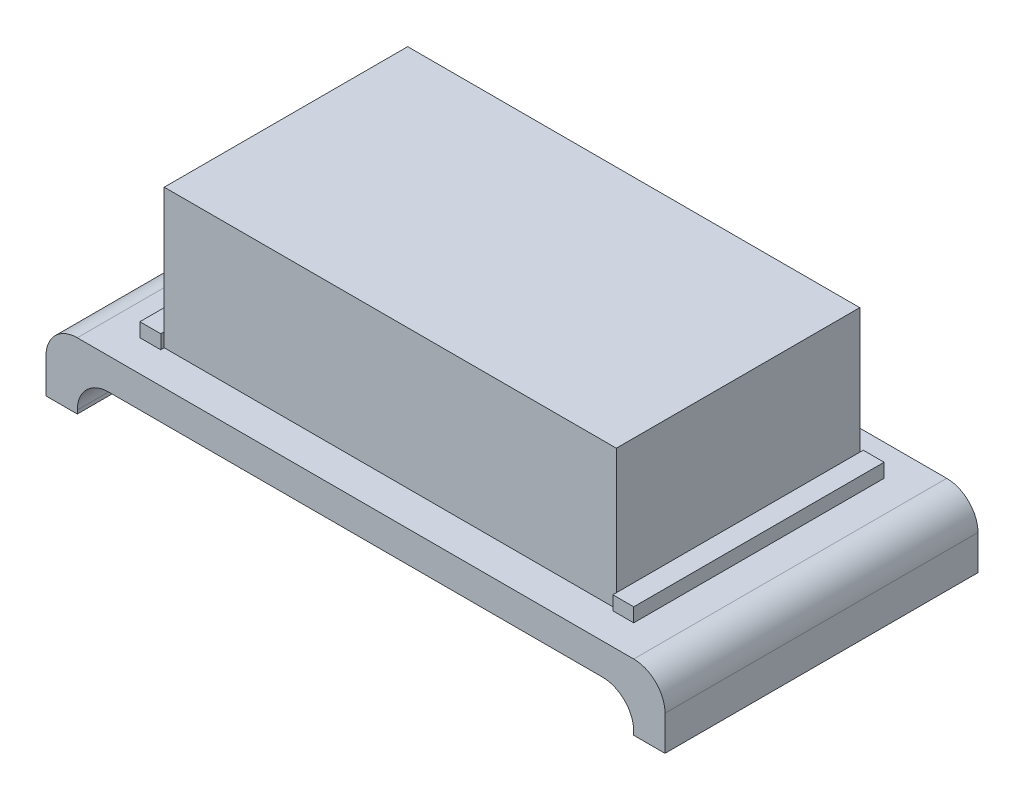
ISO-10303-21;
HEADER;
FILE_DESCRIPTION(('STEP AP214'),'2;1');
FILE_NAME('part.step','',(''),(''),'','','');
FILE_SCHEMA(('AUTOMOTIVE_DESIGN { 1 0 10303 214 1 1 1 1 }'));
ENDSEC;
DATA;
#1=APPLICATION_CONTEXT('core data for automotive mechanical design processes');
#2=APPLICATION_PROTOCOL_DEFINITION('international standard','automotive_design',2000,#1);
#3=PRODUCT_CONTEXT('',#1,'mechanical');
#4=PRODUCT('Part','Part','',(#3));
#5=PRODUCT_RELATED_PRODUCT_CATEGORY('part','',(#4));
#6=PRODUCT_DEFINITION_FORMATION('','',#4);
#7=PRODUCT_DEFINITION_CONTEXT('part definition',#1,'design');
#8=PRODUCT_DEFINITION('design','',#6,#7);
#9=PRODUCT_DEFINITION_SHAPE('','',#8);
#10=(LENGTH_UNIT() NAMED_UNIT(*) SI_UNIT(.MILLI.,.METRE.));
#11=(NAMED_UNIT(*) PLANE_ANGLE_UNIT() SI_UNIT($,.RADIAN.));
#12=(NAMED_UNIT(*) SI_UNIT($,.STERADIAN.) SOLID_ANGLE_UNIT());
#13=UNCERTAINTY_MEASURE_WITH_UNIT(LENGTH_MEASURE(1.E-05),#10,'distance_accuracy_value','');
#14=(GEOMETRIC_REPRESENTATION_CONTEXT(3) GLOBAL_UNCERTAINTY_ASSIGNED_CONTEXT((#13)) GLOBAL_UNIT_ASSIGNED_CONTEXT((#10,
#11,#12)) REPRESENTATION_CONTEXT('',''));
#15=CARTESIAN_POINT('',(0.,0.,0.));
#16=DIRECTION('',(0.,0.,1.));
#17=DIRECTION('',(1.,0.,0.));
#18=AXIS2_PLACEMENT_3D('',#15,#16,#17);
#19=CARTESIAN_POINT('',(-61.1375342465753,0.,56.3397260273973));
#20=DIRECTION('',(0.,1.,0.));
#21=DIRECTION('',(0.,0.,1.));
#22=AXIS2_PLACEMENT_3D('',#19,#20,#21);
#23=PLANE('',#22);
#24=DIRECTION('',(1.,0.,0.));
#25=VECTOR('',#24,1.);
#26=CARTESIAN_POINT('',(-61.1375342465753,0.,56.3397260273973));
#27=LINE('',#26,#25);
#28=CARTESIAN_POINT('',(-61.1375342465753,0.,56.3397260273973));
#29=VERTEX_POINT('',#28);
#30=CARTESIAN_POINT('',(98.8624657534247,0.,56.3397260273973));
#31=VERTEX_POINT('',#30);
#32=EDGE_CURVE('E372',#29,#31,#27,.T.);
#33=ORIENTED_EDGE('',*,*,#32,.T.);
#34=DIRECTION('',(0.,0.,-1.));
#35=VECTOR('',#34,1.);
#36=CARTESIAN_POINT('',(98.8624657534247,0.,56.3397260273972));
#37=LINE('',#36,#35);
#38=CARTESIAN_POINT('',(98.8624657534247,0.,-33.6602739726027));
#39=VERTEX_POINT('',#38);
#40=EDGE_CURVE('E398',#31,#39,#37,.T.);
#41=ORIENTED_EDGE('',*,*,#40,.T.);
#42=DIRECTION('',(-1.,0.,0.));
#43=VECTOR('',#42,1.);
#44=CARTESIAN_POINT('',(-61.1375342465753,0.,-33.6602739726027));
#45=LINE('',#44,#43);
#46=CARTESIAN_POINT('',(-61.1375342465753,0.,-33.6602739726027));
#47=VERTEX_POINT('',#46);
#48=EDGE_CURVE('E375',#39,#47,#45,.T.);
#49=ORIENTED_EDGE('',*,*,#48,.T.);
#50=DIRECTION('',(0.,0.,1.));
#51=VECTOR('',#50,1.);
#52=CARTESIAN_POINT('',(-61.1375342465753,0.,56.3397260273973));
#53=LINE('',#52,#51);
#54=EDGE_CURVE('E395',#47,#29,#53,.T.);
#55=ORIENTED_EDGE('',*,*,#54,.T.);
#56=EDGE_LOOP('',(#33,#41,#49,#55));
#57=FACE_BOUND('',#56,.T.);
#58=DIRECTION('',(-1.,0.,0.));
#59=VECTOR('',#58,1.);
#60=CARTESIAN_POINT('',(-46.1375342465753,0.,-23.6602739726027));
#61=LINE('',#60,#59);
#62=CARTESIAN_POINT('',(83.8624657534247,0.,-23.6602739726027));
#63=VERTEX_POINT('',#62);
#64=CARTESIAN_POINT('',(-46.1375342465753,0.,-23.6602739726027));
#65=VERTEX_POINT('',#64);
#66=EDGE_CURVE('E349',#63,#65,#61,.T.);
#67=ORIENTED_EDGE('',*,*,#66,.F.);
#68=DIRECTION('',(0.,0.,1.));
#69=VECTOR('',#68,1.);
#70=CARTESIAN_POINT('',(83.8624657534247,0.,-24.6602739726027));
#71=LINE('',#70,#69);
#72=CARTESIAN_POINT('',(83.8624657534247,0.,-24.6602739726027));
#73=VERTEX_POINT('',#72);
#74=EDGE_CURVE('E288',#73,#63,#71,.T.);
#75=ORIENTED_EDGE('',*,*,#74,.F.);
#76=DIRECTION('',(-1.,0.,0.));
#77=VECTOR('',#76,1.);
#78=CARTESIAN_POINT('',(83.8624657534247,0.,-24.6602739726027));
#79=LINE('',#78,#77);
#80=CARTESIAN_POINT('',(89.8624657534247,0.,-24.6602739726028));
#81=VERTEX_POINT('',#80);
#82=EDGE_CURVE('E266',#81,#73,#79,.T.);
#83=ORIENTED_EDGE('',*,*,#82,.F.);
#84=DIRECTION('',(0.,0.,-1.));
#85=VECTOR('',#84,1.);
#86=CARTESIAN_POINT('',(89.8624657534247,0.,-24.6602739726028));
#87=LINE('',#86,#85);
#88=CARTESIAN_POINT('',(89.8624657534247,0.,47.3397260273972));
#89=VERTEX_POINT('',#88);
#90=EDGE_CURVE('E275',#89,#81,#87,.T.);
#91=ORIENTED_EDGE('',*,*,#90,.F.);
#92=DIRECTION('',(1.,0.,0.));
#93=VECTOR('',#92,1.);
#94=CARTESIAN_POINT('',(83.8624657534247,0.,47.3397260273972));
#95=LINE('',#94,#93);
#96=CARTESIAN_POINT('',(83.8624657534247,0.,47.3397260273972));
#97=VERTEX_POINT('',#96);
#98=EDGE_CURVE('E290',#97,#89,#95,.T.);
#99=ORIENTED_EDGE('',*,*,#98,.F.);
#100=CARTESIAN_POINT('',(83.8624657534247,0.,46.3397260273973));
#101=VERTEX_POINT('',#100);
#102=EDGE_CURVE('E287',#101,#97,#71,.T.);
#103=ORIENTED_EDGE('',*,*,#102,.F.);
#104=DIRECTION('',(1.,0.,0.));
#105=VECTOR('',#104,1.);
#106=CARTESIAN_POINT('',(-46.1375342465753,0.,46.3397260273973));
#107=LINE('',#106,#105);
#108=CARTESIAN_POINT('',(-46.1375342465753,0.,46.3397260273973));
#109=VERTEX_POINT('',#108);
#110=EDGE_CURVE('E344',#109,#101,#107,.T.);
#111=ORIENTED_EDGE('',*,*,#110,.F.);
#112=DIRECTION('',(0.,0.,-1.));
#113=VECTOR('',#112,1.);
#114=CARTESIAN_POINT('',(-46.1375342465753,0.,-24.6602739726027));
#115=LINE('',#114,#113);
#116=CARTESIAN_POINT('',(-46.1375342465753,0.,47.3397260273973));
#117=VERTEX_POINT('',#116);
#118=EDGE_CURVE('E318',#117,#109,#115,.T.);
#119=ORIENTED_EDGE('',*,*,#118,.F.);
#120=DIRECTION('',(1.,0.,0.));
#121=VECTOR('',#120,1.);
#122=CARTESIAN_POINT('',(-46.1375342465753,0.,47.3397260273973));
#123=LINE('',#122,#121);
#124=CARTESIAN_POINT('',(-52.1375342465753,0.,47.3397260273973));
#125=VERTEX_POINT('',#124);
#126=EDGE_CURVE('E327',#125,#117,#123,.T.);
#127=ORIENTED_EDGE('',*,*,#126,.F.);
#128=DIRECTION('',(0.,0.,1.));
#129=VECTOR('',#128,1.);
#130=CARTESIAN_POINT('',(-52.1375342465753,0.,-24.6602739726027));
#131=LINE('',#130,#129);
#132=CARTESIAN_POINT('',(-52.1375342465753,0.,-24.6602739726027));
#133=VERTEX_POINT('',#132);
#134=EDGE_CURVE('E324',#133,#125,#131,.T.);
#135=ORIENTED_EDGE('',*,*,#134,.F.);
#136=DIRECTION('',(-1.,0.,0.));
#137=VECTOR('',#136,1.);
#138=CARTESIAN_POINT('',(-46.1375342465753,0.,-24.6602739726027));
#139=LINE('',#138,#137);
#140=CARTESIAN_POINT('',(-46.1375342465753,0.,-24.6602739726027));
#141=VERTEX_POINT('',#140);
#142=EDGE_CURVE('E321',#141,#133,#139,.T.);
#143=ORIENTED_EDGE('',*,*,#142,.F.);
#144=EDGE_CURVE('E305',#65,#141,#115,.T.);
#145=ORIENTED_EDGE('',*,*,#144,.F.);
#146=EDGE_LOOP('',(#67,#75,#83,#91,#99,#103,#111,#119,#127,#135,#143,#145));
#147=FACE_BOUND('',#146,.T.);
#148=ADVANCED_FACE('F33',(#57,#147),#23,.T.);
#149=CARTESIAN_POINT('',(83.8624657534247,40.,-23.6602739726027));
#150=DIRECTION('',(-1.,0.,0.));
#151=DIRECTION('',(0.,0.,1.));
#152=AXIS2_PLACEMENT_3D('',#149,#150,#151);
#153=PLANE('',#152);
#154=DIRECTION('',(0.,0.,1.));
#155=VECTOR('',#154,1.);
#156=CARTESIAN_POINT('',(83.8624657534247,4.,-24.6602739726027));
#157=LINE('',#156,#155);
#158=CARTESIAN_POINT('',(83.8624657534247,4.,-23.6602739726027));
#159=VERTEX_POINT('',#158);
#160=CARTESIAN_POINT('',(83.8624657534247,4.,46.3397260273973));
#161=VERTEX_POINT('',#160);
#162=EDGE_CURVE('E280',#159,#161,#157,.T.);
#163=ORIENTED_EDGE('',*,*,#162,.F.);
#164=DIRECTION('',(0.,-1.,0.));
#165=VECTOR('',#164,1.);
#166=CARTESIAN_POINT('',(83.8624657534247,40.,-23.6602739726027));
#167=LINE('',#166,#165);
#168=CARTESIAN_POINT('',(83.8624657534247,40.,-23.6602739726027));
#169=VERTEX_POINT('',#168);
#170=EDGE_CURVE('E363',#169,#159,#167,.T.);
#171=ORIENTED_EDGE('',*,*,#170,.F.);
#172=DIRECTION('',(0.,0.,-1.));
#173=VECTOR('',#172,1.);
#174=CARTESIAN_POINT('',(83.8624657534247,40.,-23.6602739726027));
#175=LINE('',#174,#173);
#176=CARTESIAN_POINT('',(83.8624657534247,40.,46.3397260273973));
#177=VERTEX_POINT('',#176);
#178=EDGE_CURVE('E351',#177,#169,#175,.T.);
#179=ORIENTED_EDGE('',*,*,#178,.F.);
#180=DIRECTION('',(0.,-1.,0.));
#181=VECTOR('',#180,1.);
#182=CARTESIAN_POINT('',(83.8624657534247,40.,46.3397260273973));
#183=LINE('',#182,#181);
#184=EDGE_CURVE('E366',#177,#161,#183,.T.);
#185=ORIENTED_EDGE('',*,*,#184,.T.);
#186=EDGE_LOOP('',(#163,#171,#179,#185));
#187=FACE_BOUND('',#186,.T.);
#188=ADVANCED_FACE('F461',(#187),#153,.F.);
#189=CARTESIAN_POINT('',(-46.1375342465753,40.,-23.6602739726027));
#190=DIRECTION('',(1.,0.,0.));
#191=DIRECTION('',(0.,0.,-1.));
#192=AXIS2_PLACEMENT_3D('',#189,#190,#191);
#193=PLANE('',#192);
#194=DIRECTION('',(0.,0.,-1.));
#195=VECTOR('',#194,1.);
#196=CARTESIAN_POINT('',(-46.1375342465753,4.,-24.6602739726027));
#197=LINE('',#196,#195);
#198=CARTESIAN_POINT('',(-46.1375342465753,4.,46.3397260273973));
#199=VERTEX_POINT('',#198);
#200=CARTESIAN_POINT('',(-46.1375342465753,4.,-23.6602739726027));
#201=VERTEX_POINT('',#200);
#202=EDGE_CURVE('E310',#199,#201,#197,.T.);
#203=ORIENTED_EDGE('',*,*,#202,.F.);
#204=DIRECTION('',(0.,-1.,0.));
#205=VECTOR('',#204,1.);
#206=CARTESIAN_POINT('',(-46.1375342465753,40.,46.3397260273973));
#207=LINE('',#206,#205);
#208=CARTESIAN_POINT('',(-46.1375342465753,40.,46.3397260273973));
#209=VERTEX_POINT('',#208);
#210=EDGE_CURVE('E369',#209,#199,#207,.T.);
#211=ORIENTED_EDGE('',*,*,#210,.F.);
#212=DIRECTION('',(0.,0.,1.));
#213=VECTOR('',#212,1.);
#214=CARTESIAN_POINT('',(-46.1375342465753,40.,-23.6602739726027));
#215=LINE('',#214,#213);
#216=CARTESIAN_POINT('',(-46.1375342465753,40.,-23.6602739726027));
#217=VERTEX_POINT('',#216);
#218=EDGE_CURVE('E345',#217,#209,#215,.T.);
#219=ORIENTED_EDGE('',*,*,#218,.F.);
#220=DIRECTION('',(0.,-1.,0.));
#221=VECTOR('',#220,1.);
#222=CARTESIAN_POINT('',(-46.1375342465753,40.,-23.6602739726027));
#223=LINE('',#222,#221);
#224=EDGE_CURVE('E359',#217,#201,#223,.T.);
#225=ORIENTED_EDGE('',*,*,#224,.T.);
#226=EDGE_LOOP('',(#203,#211,#219,#225));
#227=FACE_BOUND('',#226,.T.);
#228=ADVANCED_FACE('F466',(#227),#193,.F.);
#229=CARTESIAN_POINT('',(-61.1375342465753,-9.,-33.6602739726027));
#230=DIRECTION('',(0.,0.,-1.));
#231=DIRECTION('',(-1.,0.,0.));
#232=AXIS2_PLACEMENT_3D('',#229,#230,#231);
#233=PLANE('',#232);
#234=ORIENTED_EDGE('',*,*,#48,.F.);
#235=CARTESIAN_POINT('',(98.8624657534247,-9.,-33.6602739726027));
#236=DIRECTION('',(0.,0.,-1.));
#237=DIRECTION('',(-1.,0.,0.));
#238=AXIS2_PLACEMENT_3D('',#235,#236,#237);
#239=CIRCLE('',#238,9.);
#240=CARTESIAN_POINT('',(107.862465753425,-9.,-33.6602739726027));
#241=VERTEX_POINT('',#240);
#242=EDGE_CURVE('E403',#39,#241,#239,.T.);
#243=ORIENTED_EDGE('',*,*,#242,.T.);
#244=DIRECTION('',(0.,1.,0.));
#245=VECTOR('',#244,1.);
#246=CARTESIAN_POINT('',(107.862465753425,-19.,-33.6602739726027));
#247=LINE('',#246,#245);
#248=CARTESIAN_POINT('',(107.862465753425,-19.,-33.6602739726027));
#249=VERTEX_POINT('',#248);
#250=EDGE_CURVE('E238',#249,#241,#247,.T.);
#251=ORIENTED_EDGE('',*,*,#250,.F.);
#252=DIRECTION('',(-1.,0.,0.));
#253=VECTOR('',#252,1.);
#254=CARTESIAN_POINT('',(98.8624657534247,-19.,-33.6602739726027));
#255=LINE('',#254,#253);
#256=CARTESIAN_POINT('',(98.8624657534247,-19.,-33.6602739726027));
#257=VERTEX_POINT('',#256);
#258=EDGE_CURVE('E217',#249,#257,#255,.T.);
#259=ORIENTED_EDGE('',*,*,#258,.T.);
#260=DIRECTION('',(0.,1.,0.));
#261=VECTOR('',#260,1.);
#262=CARTESIAN_POINT('',(98.8624657534247,-19.,-33.6602739726027));
#263=LINE('',#262,#261);
#264=CARTESIAN_POINT('',(98.8624657534247,-18.,-33.6602739726027));
#265=VERTEX_POINT('',#264);
#266=EDGE_CURVE('E231',#257,#265,#263,.T.);
#267=ORIENTED_EDGE('',*,*,#266,.T.);
#268=CARTESIAN_POINT('',(89.8624657534247,-18.,-33.6602739726027));
#269=DIRECTION('',(0.,0.,-1.));
#270=DIRECTION('',(-1.,0.,0.));
#271=AXIS2_PLACEMENT_3D('',#268,#269,#270);
#272=CIRCLE('',#271,9.);
#273=CARTESIAN_POINT('',(89.8624657534247,-9.,-33.6602739726027));
#274=VERTEX_POINT('',#273);
#275=EDGE_CURVE('E411',#265,#274,#272,.F.);
#276=ORIENTED_EDGE('',*,*,#275,.T.);
#277=DIRECTION('',(-1.,0.,0.));
#278=VECTOR('',#277,1.);
#279=CARTESIAN_POINT('',(-61.1375342465753,-9.,-33.6602739726027));
#280=LINE('',#279,#278);
#281=CARTESIAN_POINT('',(-52.1375342465753,-9.,-33.6602739726027));
#282=VERTEX_POINT('',#281);
#283=EDGE_CURVE('E386',#274,#282,#280,.T.);
#284=ORIENTED_EDGE('',*,*,#283,.T.);
#285=CARTESIAN_POINT('',(-52.1375342465753,-18.,-33.6602739726027));
#286=DIRECTION('',(0.,0.,-1.));
#287=DIRECTION('',(-1.,0.,0.));
#288=AXIS2_PLACEMENT_3D('',#285,#286,#287);
#289=CIRCLE('',#288,9.);
#290=CARTESIAN_POINT('',(-61.1375342465753,-18.,-33.6602739726027));
#291=VERTEX_POINT('',#290);
#292=EDGE_CURVE('E11',#282,#291,#289,.F.);
#293=ORIENTED_EDGE('',*,*,#292,.T.);
#294=DIRECTION('',(0.,1.,0.));
#295=VECTOR('',#294,1.);
#296=CARTESIAN_POINT('',(-61.1375342465753,-19.,-33.6602739726027));
#297=LINE('',#296,#295);
#298=CARTESIAN_POINT('',(-61.1375342465753,-19.,-33.6602739726027));
#299=VERTEX_POINT('',#298);
#300=EDGE_CURVE('E256',#299,#291,#297,.T.);
#301=ORIENTED_EDGE('',*,*,#300,.F.);
#302=DIRECTION('',(-1.,0.,0.));
#303=VECTOR('',#302,1.);
#304=CARTESIAN_POINT('',(-61.1375342465753,-19.,-33.6602739726027));
#305=LINE('',#304,#303);
#306=CARTESIAN_POINT('',(-70.1375342465753,-19.,-33.6602739726027));
#307=VERTEX_POINT('',#306);
#308=EDGE_CURVE('E247',#299,#307,#305,.T.);
#309=ORIENTED_EDGE('',*,*,#308,.T.);
#310=DIRECTION('',(0.,1.,0.));
#311=VECTOR('',#310,1.);
#312=CARTESIAN_POINT('',(-70.1375342465753,-19.,-33.6602739726027));
#313=LINE('',#312,#311);
#314=CARTESIAN_POINT('',(-70.1375342465753,-9.,-33.6602739726027));
#315=VERTEX_POINT('',#314);
#316=EDGE_CURVE('E270',#307,#315,#313,.T.);
#317=ORIENTED_EDGE('',*,*,#316,.T.);
#318=CARTESIAN_POINT('',(-61.1375342465753,-9.,-33.6602739726027));
#319=DIRECTION('',(0.,0.,-1.));
#320=DIRECTION('',(-1.,0.,0.));
#321=AXIS2_PLACEMENT_3D('',#318,#319,#320);
#322=CIRCLE('',#321,9.);
#323=EDGE_CURVE('E401',#315,#47,#322,.T.);
#324=ORIENTED_EDGE('',*,*,#323,.T.);
#325=EDGE_LOOP('',(#234,#243,#251,#259,#267,#276,#284,#293,#301,#309,#317,#324));
#326=FACE_BOUND('',#325,.T.);
#327=ADVANCED_FACE('F426',(#326),#233,.T.);
#328=CARTESIAN_POINT('',(-61.1375342465753,-9.,56.3397260273973));
#329=DIRECTION('',(0.,0.,1.));
#330=DIRECTION('',(1.,0.,0.));
#331=AXIS2_PLACEMENT_3D('',#328,#329,#330);
#332=PLANE('',#331);
#333=DIRECTION('',(0.,1.,0.));
#334=VECTOR('',#333,1.);
#335=CARTESIAN_POINT('',(107.862465753425,-19.,56.3397260273973));
#336=LINE('',#335,#334);
#337=CARTESIAN_POINT('',(107.862465753425,-19.,56.3397260273973));
#338=VERTEX_POINT('',#337);
#339=CARTESIAN_POINT('',(107.862465753425,-9.,56.3397260273973));
#340=VERTEX_POINT('',#339);
#341=EDGE_CURVE('E216',#338,#340,#336,.T.);
#342=ORIENTED_EDGE('',*,*,#341,.T.);
#343=CARTESIAN_POINT('',(98.8624657534247,-9.,56.3397260273973));
#344=DIRECTION('',(0.,0.,1.));
#345=DIRECTION('',(1.,0.,0.));
#346=AXIS2_PLACEMENT_3D('',#343,#344,#345);
#347=CIRCLE('',#346,9.);
#348=EDGE_CURVE('E407',#340,#31,#347,.T.);
#349=ORIENTED_EDGE('',*,*,#348,.T.);
#350=ORIENTED_EDGE('',*,*,#32,.F.);
#351=CARTESIAN_POINT('',(-61.1375342465753,-9.,56.3397260273973));
#352=DIRECTION('',(0.,0.,1.));
#353=DIRECTION('',(1.,0.,0.));
#354=AXIS2_PLACEMENT_3D('',#351,#352,#353);
#355=CIRCLE('',#354,9.);
#356=CARTESIAN_POINT('',(-70.1375342465753,-9.,56.3397260273973));
#357=VERTEX_POINT('',#356);
#358=EDGE_CURVE('E48',#29,#357,#355,.T.);
#359=ORIENTED_EDGE('',*,*,#358,.T.);
#360=DIRECTION('',(0.,1.,0.));
#361=VECTOR('',#360,1.);
#362=CARTESIAN_POINT('',(-70.1375342465753,-19.,56.3397260273973));
#363=LINE('',#362,#361);
#364=CARTESIAN_POINT('',(-70.1375342465753,-19.,56.3397260273973));
#365=VERTEX_POINT('',#364);
#366=EDGE_CURVE('E259',#365,#357,#363,.T.);
#367=ORIENTED_EDGE('',*,*,#366,.F.);
#368=DIRECTION('',(1.,0.,0.));
#369=VECTOR('',#368,1.);
#370=CARTESIAN_POINT('',(-61.1375342465753,-19.,56.3397260273973));
#371=LINE('',#370,#369);
#372=CARTESIAN_POINT('',(-61.1375342465753,-19.,56.3397260273973));
#373=VERTEX_POINT('',#372);
#374=EDGE_CURVE('E253',#365,#373,#371,.T.);
#375=ORIENTED_EDGE('',*,*,#374,.T.);
#376=DIRECTION('',(0.,1.,0.));
#377=VECTOR('',#376,1.);
#378=CARTESIAN_POINT('',(-61.1375342465753,-19.,56.3397260273973));
#379=LINE('',#378,#377);
#380=CARTESIAN_POINT('',(-61.1375342465753,-18.,56.3397260273973));
#381=VERTEX_POINT('',#380);
#382=EDGE_CURVE('E262',#373,#381,#379,.T.);
#383=ORIENTED_EDGE('',*,*,#382,.T.);
#384=CARTESIAN_POINT('',(-52.1375342465753,-18.,56.3397260273973));
#385=DIRECTION('',(0.,0.,1.));
#386=DIRECTION('',(1.,0.,0.));
#387=AXIS2_PLACEMENT_3D('',#384,#385,#386);
#388=CIRCLE('',#387,9.);
#389=CARTESIAN_POINT('',(-52.1375342465753,-9.,56.3397260273973));
#390=VERTEX_POINT('',#389);
#391=EDGE_CURVE('E41',#381,#390,#388,.F.);
#392=ORIENTED_EDGE('',*,*,#391,.T.);
#393=DIRECTION('',(1.,0.,0.));
#394=VECTOR('',#393,1.);
#395=CARTESIAN_POINT('',(-61.1375342465753,-9.,56.3397260273973));
#396=LINE('',#395,#394);
#397=CARTESIAN_POINT('',(89.8624657534247,-9.,56.3397260273973));
#398=VERTEX_POINT('',#397);
#399=EDGE_CURVE('E378',#390,#398,#396,.T.);
#400=ORIENTED_EDGE('',*,*,#399,.T.);
#401=CARTESIAN_POINT('',(89.8624657534247,-18.,56.3397260273973));
#402=DIRECTION('',(0.,0.,1.));
#403=DIRECTION('',(1.,0.,0.));
#404=AXIS2_PLACEMENT_3D('',#401,#402,#403);
#405=CIRCLE('',#404,9.);
#406=CARTESIAN_POINT('',(98.8624657534247,-18.,56.3397260273973));
#407=VERTEX_POINT('',#406);
#408=EDGE_CURVE('E211',#398,#407,#405,.F.);
#409=ORIENTED_EDGE('',*,*,#408,.T.);
#410=DIRECTION('',(0.,1.,0.));
#411=VECTOR('',#410,1.);
#412=CARTESIAN_POINT('',(98.8624657534247,-19.,56.3397260273973));
#413=LINE('',#412,#411);
#414=CARTESIAN_POINT('',(98.8624657534247,-19.,56.3397260273973));
#415=VERTEX_POINT('',#414);
#416=EDGE_CURVE('E205',#415,#407,#413,.T.);
#417=ORIENTED_EDGE('',*,*,#416,.F.);
#418=DIRECTION('',(1.,0.,0.));
#419=VECTOR('',#418,1.);
#420=CARTESIAN_POINT('',(98.8624657534247,-19.,56.3397260273973));
#421=LINE('',#420,#419);
#422=EDGE_CURVE('E208',#415,#338,#421,.T.);
#423=ORIENTED_EDGE('',*,*,#422,.T.);
#424=EDGE_LOOP('',(#342,#349,#350,#359,#367,#375,#383,#392,#400,#409,#417,#423));
#425=FACE_BOUND('',#424,.T.);
#426=ADVANCED_FACE('F207',(#425),#332,.T.);
#427=CARTESIAN_POINT('',(-61.1375342465753,-9.,56.3397260273973));
#428=DIRECTION('',(0.,1.,0.));
#429=DIRECTION('',(0.,0.,1.));
#430=AXIS2_PLACEMENT_3D('',#427,#428,#429);
#431=PLANE('',#430);
#432=ORIENTED_EDGE('',*,*,#283,.F.);
#433=DIRECTION('',(0.,0.,-1.));
#434=VECTOR('',#433,1.);
#435=CARTESIAN_POINT('',(89.8624657534247,-9.,56.3397260273973));
#436=LINE('',#435,#434);
#437=EDGE_CURVE('E389',#274,#398,#436,.F.);
#438=ORIENTED_EDGE('',*,*,#437,.T.);
#439=ORIENTED_EDGE('',*,*,#399,.F.);
#440=DIRECTION('',(0.,0.,1.));
#441=VECTOR('',#440,1.);
#442=CARTESIAN_POINT('',(-52.1375342465753,-9.,56.3397260273973));
#443=LINE('',#442,#441);
#444=EDGE_CURVE('E387',#390,#282,#443,.F.);
#445=ORIENTED_EDGE('',*,*,#444,.T.);
#446=EDGE_LOOP('',(#432,#438,#439,#445));
#447=FACE_BOUND('',#446,.T.);
#448=ADVANCED_FACE('F419',(#447),#431,.F.);
#449=CARTESIAN_POINT('',(-46.1375342465753,40.,46.3397260273973));
#450=DIRECTION('',(0.,0.,-1.));
#451=DIRECTION('',(-1.,0.,0.));
#452=AXIS2_PLACEMENT_3D('',#449,#450,#451);
#453=PLANE('',#452);
#454=ORIENTED_EDGE('',*,*,#110,.T.);
#455=DIRECTION('',(0.,-1.,0.));
#456=VECTOR('',#455,1.);
#457=CARTESIAN_POINT('',(83.8624657534247,40.,46.3397260273973));
#458=LINE('',#457,#456);
#459=EDGE_CURVE('E303',#161,#101,#458,.T.);
#460=ORIENTED_EDGE('',*,*,#459,.F.);
#461=ORIENTED_EDGE('',*,*,#184,.F.);
#462=DIRECTION('',(1.,0.,0.));
#463=VECTOR('',#462,1.);
#464=CARTESIAN_POINT('',(-46.1375342465753,40.,46.3397260273973));
#465=LINE('',#464,#463);
#466=EDGE_CURVE('E348',#209,#177,#465,.T.);
#467=ORIENTED_EDGE('',*,*,#466,.F.);
#468=ORIENTED_EDGE('',*,*,#210,.T.);
#469=DIRECTION('',(0.,1.,0.));
#470=VECTOR('',#469,1.);
#471=CARTESIAN_POINT('',(-46.1375342465753,40.,46.3397260273973));
#472=LINE('',#471,#470);
#473=EDGE_CURVE('E341',#109,#199,#472,.T.);
#474=ORIENTED_EDGE('',*,*,#473,.F.);
#475=EDGE_LOOP('',(#454,#460,#461,#467,#468,#474));
#476=FACE_BOUND('',#475,.T.);
#477=ADVANCED_FACE('F477',(#476),#453,.F.);
#478=CARTESIAN_POINT('',(-46.1375342465753,40.,-23.6602739726027));
#479=DIRECTION('',(0.,0.,1.));
#480=DIRECTION('',(1.,0.,0.));
#481=AXIS2_PLACEMENT_3D('',#478,#479,#480);
#482=PLANE('',#481);
#483=ORIENTED_EDGE('',*,*,#66,.T.);
#484=EDGE_CURVE('E355',#201,#65,#223,.T.);
#485=ORIENTED_EDGE('',*,*,#484,.F.);
#486=ORIENTED_EDGE('',*,*,#224,.F.);
#487=DIRECTION('',(-1.,0.,0.));
#488=VECTOR('',#487,1.);
#489=CARTESIAN_POINT('',(-46.1375342465753,40.,-23.6602739726027));
#490=LINE('',#489,#488);
#491=EDGE_CURVE('E353',#169,#217,#490,.T.);
#492=ORIENTED_EDGE('',*,*,#491,.F.);
#493=ORIENTED_EDGE('',*,*,#170,.T.);
#494=EDGE_CURVE('E362',#159,#63,#167,.T.);
#495=ORIENTED_EDGE('',*,*,#494,.T.);
#496=EDGE_LOOP('',(#483,#485,#486,#492,#493,#495));
#497=FACE_BOUND('',#496,.T.);
#498=ADVANCED_FACE('F481',(#497),#482,.F.);
#499=CARTESIAN_POINT('',(-46.1375342465753,40.,46.3397260273973));
#500=DIRECTION('',(0.,1.,0.));
#501=DIRECTION('',(0.,0.,1.));
#502=AXIS2_PLACEMENT_3D('',#499,#500,#501);
#503=PLANE('',#502);
#504=ORIENTED_EDGE('',*,*,#218,.T.);
#505=ORIENTED_EDGE('',*,*,#466,.T.);
#506=ORIENTED_EDGE('',*,*,#178,.T.);
#507=ORIENTED_EDGE('',*,*,#491,.T.);
#508=EDGE_LOOP('',(#504,#505,#506,#507));
#509=FACE_BOUND('',#508,.T.);
#510=ADVANCED_FACE('F487',(#509),#503,.T.);
#511=CARTESIAN_POINT('',(-46.1375342465753,4.,-24.6602739726027));
#512=DIRECTION('',(-1.,0.,0.));
#513=DIRECTION('',(0.,0.,1.));
#514=AXIS2_PLACEMENT_3D('',#511,#512,#513);
#515=PLANE('',#514);
#516=ORIENTED_EDGE('',*,*,#118,.T.);
#517=ORIENTED_EDGE('',*,*,#473,.T.);
#518=CARTESIAN_POINT('',(-46.1375342465753,4.,47.3397260273973));
#519=VERTEX_POINT('',#518);
#520=EDGE_CURVE('E306',#519,#199,#197,.T.);
#521=ORIENTED_EDGE('',*,*,#520,.F.);
#522=DIRECTION('',(0.,-1.,0.));
#523=VECTOR('',#522,1.);
#524=CARTESIAN_POINT('',(-46.1375342465753,4.,47.3397260273973));
#525=LINE('',#524,#523);
#526=EDGE_CURVE('E317',#519,#117,#525,.T.);
#527=ORIENTED_EDGE('',*,*,#526,.T.);
#528=EDGE_LOOP('',(#516,#517,#521,#527));
#529=FACE_BOUND('',#528,.T.);
#530=ADVANCED_FACE('F504',(#529),#515,.F.);
#531=CARTESIAN_POINT('',(-46.1375342465753,4.,-24.6602739726027));
#532=VERTEX_POINT('',#531);
#533=EDGE_CURVE('E311',#201,#532,#197,.T.);
#534=ORIENTED_EDGE('',*,*,#533,.F.);
#535=ORIENTED_EDGE('',*,*,#484,.T.);
#536=ORIENTED_EDGE('',*,*,#144,.T.);
#537=DIRECTION('',(0.,-1.,0.));
#538=VECTOR('',#537,1.);
#539=CARTESIAN_POINT('',(-46.1375342465753,4.,-24.6602739726027));
#540=LINE('',#539,#538);
#541=EDGE_CURVE('E338',#532,#141,#540,.T.);
#542=ORIENTED_EDGE('',*,*,#541,.F.);
#543=EDGE_LOOP('',(#534,#535,#536,#542));
#544=FACE_BOUND('',#543,.T.);
#545=ADVANCED_FACE('F524',(#544),#515,.F.);
#546=CARTESIAN_POINT('',(-46.1375342465753,4.,-24.6602739726027));
#547=DIRECTION('',(0.,0.,1.));
#548=DIRECTION('',(1.,0.,0.));
#549=AXIS2_PLACEMENT_3D('',#546,#547,#548);
#550=PLANE('',#549);
#551=ORIENTED_EDGE('',*,*,#142,.T.);
#552=DIRECTION('',(0.,-1.,0.));
#553=VECTOR('',#552,1.);
#554=CARTESIAN_POINT('',(-52.1375342465753,4.,-24.6602739726027));
#555=LINE('',#554,#553);
#556=CARTESIAN_POINT('',(-52.1375342465753,4.,-24.6602739726027));
#557=VERTEX_POINT('',#556);
#558=EDGE_CURVE('E335',#557,#133,#555,.T.);
#559=ORIENTED_EDGE('',*,*,#558,.F.);
#560=DIRECTION('',(-1.,0.,0.));
#561=VECTOR('',#560,1.);
#562=CARTESIAN_POINT('',(-46.1375342465753,4.,-24.6602739726027));
#563=LINE('',#562,#561);
#564=EDGE_CURVE('E309',#532,#557,#563,.T.);
#565=ORIENTED_EDGE('',*,*,#564,.F.);
#566=ORIENTED_EDGE('',*,*,#541,.T.);
#567=EDGE_LOOP('',(#551,#559,#565,#566));
#568=FACE_BOUND('',#567,.T.);
#569=ADVANCED_FACE('F518',(#568),#550,.F.);
#570=CARTESIAN_POINT('',(-52.1375342465753,4.,-24.6602739726027));
#571=DIRECTION('',(1.,0.,0.));
#572=DIRECTION('',(0.,0.,-1.));
#573=AXIS2_PLACEMENT_3D('',#570,#571,#572);
#574=PLANE('',#573);
#575=ORIENTED_EDGE('',*,*,#134,.T.);
#576=DIRECTION('',(0.,-1.,0.));
#577=VECTOR('',#576,1.);
#578=CARTESIAN_POINT('',(-52.1375342465753,4.,47.3397260273973));
#579=LINE('',#578,#577);
#580=CARTESIAN_POINT('',(-52.1375342465753,4.,47.3397260273973));
#581=VERTEX_POINT('',#580);
#582=EDGE_CURVE('E332',#581,#125,#579,.T.);
#583=ORIENTED_EDGE('',*,*,#582,.F.);
#584=DIRECTION('',(0.,0.,1.));
#585=VECTOR('',#584,1.);
#586=CARTESIAN_POINT('',(-52.1375342465753,4.,-24.6602739726027));
#587=LINE('',#586,#585);
#588=EDGE_CURVE('E313',#557,#581,#587,.T.);
#589=ORIENTED_EDGE('',*,*,#588,.F.);
#590=ORIENTED_EDGE('',*,*,#558,.T.);
#591=EDGE_LOOP('',(#575,#583,#589,#590));
#592=FACE_BOUND('',#591,.T.);
#593=ADVANCED_FACE('F514',(#592),#574,.F.);
#594=CARTESIAN_POINT('',(-46.1375342465753,4.,47.3397260273973));
#595=DIRECTION('',(0.,0.,-1.));
#596=DIRECTION('',(-1.,0.,0.));
#597=AXIS2_PLACEMENT_3D('',#594,#595,#596);
#598=PLANE('',#597);
#599=ORIENTED_EDGE('',*,*,#126,.T.);
#600=ORIENTED_EDGE('',*,*,#526,.F.);
#601=DIRECTION('',(1.,0.,0.));
#602=VECTOR('',#601,1.);
#603=CARTESIAN_POINT('',(-46.1375342465753,4.,47.3397260273973));
#604=LINE('',#603,#602);
#605=EDGE_CURVE('E315',#581,#519,#604,.T.);
#606=ORIENTED_EDGE('',*,*,#605,.F.);
#607=ORIENTED_EDGE('',*,*,#582,.T.);
#608=EDGE_LOOP('',(#599,#600,#606,#607));
#609=FACE_BOUND('',#608,.T.);
#610=ADVANCED_FACE('F511',(#609),#598,.F.);
#611=CARTESIAN_POINT('',(-46.1375342465753,4.,47.3397260273973));
#612=DIRECTION('',(0.,-1.,0.));
#613=DIRECTION('',(0.,0.,-1.));
#614=AXIS2_PLACEMENT_3D('',#611,#612,#613);
#615=PLANE('',#614);
#616=ORIENTED_EDGE('',*,*,#520,.T.);
#617=ORIENTED_EDGE('',*,*,#202,.T.);
#618=ORIENTED_EDGE('',*,*,#533,.T.);
#619=ORIENTED_EDGE('',*,*,#564,.T.);
#620=ORIENTED_EDGE('',*,*,#588,.T.);
#621=ORIENTED_EDGE('',*,*,#605,.T.);
#622=EDGE_LOOP('',(#616,#617,#618,#619,#620,#621));
#623=FACE_BOUND('',#622,.T.);
#624=ADVANCED_FACE('F505',(#623),#615,.F.);
#625=CARTESIAN_POINT('',(83.8624657534247,4.,-24.6602739726027));
#626=DIRECTION('',(1.,0.,0.));
#627=DIRECTION('',(0.,0.,-1.));
#628=AXIS2_PLACEMENT_3D('',#625,#626,#627);
#629=PLANE('',#628);
#630=CARTESIAN_POINT('',(83.8624657534247,4.,47.3397260273972));
#631=VERTEX_POINT('',#630);
#632=EDGE_CURVE('E274',#161,#631,#157,.T.);
#633=ORIENTED_EDGE('',*,*,#632,.F.);
#634=ORIENTED_EDGE('',*,*,#459,.T.);
#635=ORIENTED_EDGE('',*,*,#102,.T.);
#636=DIRECTION('',(0.,-1.,0.));
#637=VECTOR('',#636,1.);
#638=CARTESIAN_POINT('',(83.8624657534247,4.,47.3397260273972));
#639=LINE('',#638,#637);
#640=EDGE_CURVE('E298',#631,#97,#639,.T.);
#641=ORIENTED_EDGE('',*,*,#640,.F.);
#642=EDGE_LOOP('',(#633,#634,#635,#641));
#643=FACE_BOUND('',#642,.T.);
#644=ADVANCED_FACE('F548',(#643),#629,.F.);
#645=ORIENTED_EDGE('',*,*,#74,.T.);
#646=ORIENTED_EDGE('',*,*,#494,.F.);
#647=CARTESIAN_POINT('',(83.8624657534247,4.,-24.6602739726027));
#648=VERTEX_POINT('',#647);
#649=EDGE_CURVE('E276',#648,#159,#157,.T.);
#650=ORIENTED_EDGE('',*,*,#649,.F.);
#651=DIRECTION('',(0.,-1.,0.));
#652=VECTOR('',#651,1.);
#653=CARTESIAN_POINT('',(83.8624657534247,4.,-24.6602739726027));
#654=LINE('',#653,#652);
#655=EDGE_CURVE('E301',#648,#73,#654,.T.);
#656=ORIENTED_EDGE('',*,*,#655,.T.);
#657=EDGE_LOOP('',(#645,#646,#650,#656));
#658=FACE_BOUND('',#657,.T.);
#659=ADVANCED_FACE('F531',(#658),#629,.F.);
#660=CARTESIAN_POINT('',(83.8624657534247,4.,-24.6602739726027));
#661=DIRECTION('',(0.,0.,1.));
#662=DIRECTION('',(1.,0.,0.));
#663=AXIS2_PLACEMENT_3D('',#660,#661,#662);
#664=PLANE('',#663);
#665=ORIENTED_EDGE('',*,*,#82,.T.);
#666=ORIENTED_EDGE('',*,*,#655,.F.);
#667=DIRECTION('',(-1.,0.,0.));
#668=VECTOR('',#667,1.);
#669=CARTESIAN_POINT('',(83.8624657534247,4.,-24.6602739726027));
#670=LINE('',#669,#668);
#671=CARTESIAN_POINT('',(89.8624657534247,4.,-24.6602739726028));
#672=VERTEX_POINT('',#671);
#673=EDGE_CURVE('E271',#672,#648,#670,.T.);
#674=ORIENTED_EDGE('',*,*,#673,.F.);
#675=DIRECTION('',(0.,-1.,0.));
#676=VECTOR('',#675,1.);
#677=CARTESIAN_POINT('',(89.8624657534247,4.,-24.6602739726028));
#678=LINE('',#677,#676);
#679=EDGE_CURVE('E284',#672,#81,#678,.T.);
#680=ORIENTED_EDGE('',*,*,#679,.T.);
#681=EDGE_LOOP('',(#665,#666,#674,#680));
#682=FACE_BOUND('',#681,.T.);
#683=ADVANCED_FACE('F535',(#682),#664,.F.);
#684=CARTESIAN_POINT('',(83.8624657534247,4.,47.3397260273972));
#685=DIRECTION('',(0.,0.,-1.));
#686=DIRECTION('',(-1.,0.,0.));
#687=AXIS2_PLACEMENT_3D('',#684,#685,#686);
#688=PLANE('',#687);
#689=ORIENTED_EDGE('',*,*,#98,.T.);
#690=DIRECTION('',(0.,-1.,0.));
#691=VECTOR('',#690,1.);
#692=CARTESIAN_POINT('',(89.8624657534247,4.,47.3397260273972));
#693=LINE('',#692,#691);
#694=CARTESIAN_POINT('',(89.8624657534247,4.,47.3397260273972));
#695=VERTEX_POINT('',#694);
#696=EDGE_CURVE('E295',#695,#89,#693,.T.);
#697=ORIENTED_EDGE('',*,*,#696,.F.);
#698=DIRECTION('',(1.,0.,0.));
#699=VECTOR('',#698,1.);
#700=CARTESIAN_POINT('',(83.8624657534247,4.,47.3397260273972));
#701=LINE('',#700,#699);
#702=EDGE_CURVE('E279',#631,#695,#701,.T.);
#703=ORIENTED_EDGE('',*,*,#702,.F.);
#704=ORIENTED_EDGE('',*,*,#640,.T.);
#705=EDGE_LOOP('',(#689,#697,#703,#704));
#706=FACE_BOUND('',#705,.T.);
#707=ADVANCED_FACE('F544',(#706),#688,.F.);
#708=CARTESIAN_POINT('',(89.8624657534247,4.,-24.6602739726028));
#709=DIRECTION('',(-1.,0.,0.));
#710=DIRECTION('',(0.,0.,1.));
#711=AXIS2_PLACEMENT_3D('',#708,#709,#710);
#712=PLANE('',#711);
#713=ORIENTED_EDGE('',*,*,#90,.T.);
#714=ORIENTED_EDGE('',*,*,#679,.F.);
#715=DIRECTION('',(0.,0.,-1.));
#716=VECTOR('',#715,1.);
#717=CARTESIAN_POINT('',(89.8624657534247,4.,-24.6602739726028));
#718=LINE('',#717,#716);
#719=EDGE_CURVE('E282',#695,#672,#718,.T.);
#720=ORIENTED_EDGE('',*,*,#719,.F.);
#721=ORIENTED_EDGE('',*,*,#696,.T.);
#722=EDGE_LOOP('',(#713,#714,#720,#721));
#723=FACE_BOUND('',#722,.T.);
#724=ADVANCED_FACE('F539',(#723),#712,.F.);
#725=CARTESIAN_POINT('',(89.8624657534247,4.,-24.6602739726028));
#726=DIRECTION('',(0.,-1.,0.));
#727=DIRECTION('',(0.,0.,-1.));
#728=AXIS2_PLACEMENT_3D('',#725,#726,#727);
#729=PLANE('',#728);
#730=ORIENTED_EDGE('',*,*,#673,.T.);
#731=ORIENTED_EDGE('',*,*,#649,.T.);
#732=ORIENTED_EDGE('',*,*,#162,.T.);
#733=ORIENTED_EDGE('',*,*,#632,.T.);
#734=ORIENTED_EDGE('',*,*,#702,.T.);
#735=ORIENTED_EDGE('',*,*,#719,.T.);
#736=EDGE_LOOP('',(#730,#731,#732,#733,#734,#735));
#737=FACE_BOUND('',#736,.T.);
#738=ADVANCED_FACE('F578',(#737),#729,.F.);
#739=CARTESIAN_POINT('',(-61.1375342465753,-19.,-33.6602739726027));
#740=DIRECTION('',(1.,0.,0.));
#741=DIRECTION('',(0.,0.,-1.));
#742=AXIS2_PLACEMENT_3D('',#739,#740,#741);
#743=PLANE('',#742);
#744=ORIENTED_EDGE('',*,*,#300,.T.);
#745=DIRECTION('',(0.,0.,1.));
#746=VECTOR('',#745,1.);
#747=CARTESIAN_POINT('',(-61.1375342465753,-18.,-33.6602739726027));
#748=LINE('',#747,#746);
#749=EDGE_CURVE('E392',#291,#381,#748,.T.);
#750=ORIENTED_EDGE('',*,*,#749,.T.);
#751=ORIENTED_EDGE('',*,*,#382,.F.);
#752=DIRECTION('',(0.,0.,-1.));
#753=VECTOR('',#752,1.);
#754=CARTESIAN_POINT('',(-61.1375342465753,-19.,-33.6602739726027));
#755=LINE('',#754,#753);
#756=EDGE_CURVE('E242',#373,#299,#755,.T.);
#757=ORIENTED_EDGE('',*,*,#756,.T.);
#758=EDGE_LOOP('',(#744,#750,#751,#757));
#759=FACE_BOUND('',#758,.T.);
#760=ADVANCED_FACE('F429',(#759),#743,.T.);
#761=CARTESIAN_POINT('',(-70.1375342465753,-19.,-33.6602739726027));
#762=DIRECTION('',(-1.,0.,0.));
#763=DIRECTION('',(0.,0.,1.));
#764=AXIS2_PLACEMENT_3D('',#761,#762,#763);
#765=PLANE('',#764);
#766=ORIENTED_EDGE('',*,*,#366,.T.);
#767=DIRECTION('',(0.,0.,1.));
#768=VECTOR('',#767,1.);
#769=CARTESIAN_POINT('',(-70.1375342465753,-9.,-33.6602739726027));
#770=LINE('',#769,#768);
#771=EDGE_CURVE('E409',#357,#315,#770,.F.);
#772=ORIENTED_EDGE('',*,*,#771,.T.);
#773=ORIENTED_EDGE('',*,*,#316,.F.);
#774=DIRECTION('',(0.,0.,1.));
#775=VECTOR('',#774,1.);
#776=CARTESIAN_POINT('',(-70.1375342465753,-19.,-33.6602739726027));
#777=LINE('',#776,#775);
#778=EDGE_CURVE('E250',#307,#365,#777,.T.);
#779=ORIENTED_EDGE('',*,*,#778,.T.);
#780=EDGE_LOOP('',(#766,#772,#773,#779));
#781=FACE_BOUND('',#780,.T.);
#782=ADVANCED_FACE('F437',(#781),#765,.T.);
#783=CARTESIAN_POINT('',(-61.1375342465753,-19.,56.3397260273973));
#784=DIRECTION('',(0.,-1.,0.));
#785=DIRECTION('',(0.,0.,-1.));
#786=AXIS2_PLACEMENT_3D('',#783,#784,#785);
#787=PLANE('',#786);
#788=ORIENTED_EDGE('',*,*,#756,.F.);
#789=ORIENTED_EDGE('',*,*,#374,.F.);
#790=ORIENTED_EDGE('',*,*,#778,.F.);
#791=ORIENTED_EDGE('',*,*,#308,.F.);
#792=EDGE_LOOP('',(#788,#789,#790,#791));
#793=FACE_BOUND('',#792,.T.);
#794=ADVANCED_FACE('F433',(#793),#787,.T.);
#795=CARTESIAN_POINT('',(98.8624657534247,-19.,-33.6602739726027));
#796=DIRECTION('',(-1.,0.,0.));
#797=DIRECTION('',(0.,0.,1.));
#798=AXIS2_PLACEMENT_3D('',#795,#796,#797);
#799=PLANE('',#798);
#800=ORIENTED_EDGE('',*,*,#416,.T.);
#801=DIRECTION('',(0.,0.,-1.));
#802=VECTOR('',#801,1.);
#803=CARTESIAN_POINT('',(98.8624657534247,-18.,-33.6602739726027));
#804=LINE('',#803,#802);
#805=EDGE_CURVE('E390',#407,#265,#804,.T.);
#806=ORIENTED_EDGE('',*,*,#805,.T.);
#807=ORIENTED_EDGE('',*,*,#266,.F.);
#808=DIRECTION('',(0.,0.,1.));
#809=VECTOR('',#808,1.);
#810=CARTESIAN_POINT('',(98.8624657534247,-19.,-33.6602739726027));
#811=LINE('',#810,#809);
#812=EDGE_CURVE('E224',#257,#415,#811,.T.);
#813=ORIENTED_EDGE('',*,*,#812,.T.);
#814=EDGE_LOOP('',(#800,#806,#807,#813));
#815=FACE_BOUND('',#814,.T.);
#816=ADVANCED_FACE('F229',(#815),#799,.T.);
#817=CARTESIAN_POINT('',(107.862465753425,-19.,-33.6602739726027));
#818=DIRECTION('',(1.,0.,0.));
#819=DIRECTION('',(0.,0.,-1.));
#820=AXIS2_PLACEMENT_3D('',#817,#818,#819);
#821=PLANE('',#820);
#822=ORIENTED_EDGE('',*,*,#250,.T.);
#823=DIRECTION('',(0.,0.,-1.));
#824=VECTOR('',#823,1.);
#825=CARTESIAN_POINT('',(107.862465753425,-9.,-33.6602739726027));
#826=LINE('',#825,#824);
#827=EDGE_CURVE('E56',#241,#340,#826,.F.);
#828=ORIENTED_EDGE('',*,*,#827,.T.);
#829=ORIENTED_EDGE('',*,*,#341,.F.);
#830=DIRECTION('',(0.,0.,-1.));
#831=VECTOR('',#830,1.);
#832=CARTESIAN_POINT('',(107.862465753425,-19.,-33.6602739726027));
#833=LINE('',#832,#831);
#834=EDGE_CURVE('E227',#338,#249,#833,.T.);
#835=ORIENTED_EDGE('',*,*,#834,.T.);
#836=EDGE_LOOP('',(#822,#828,#829,#835));
#837=FACE_BOUND('',#836,.T.);
#838=ADVANCED_FACE('F448',(#837),#821,.T.);
#839=CARTESIAN_POINT('',(98.8624657534247,-19.,56.3397260273973));
#840=DIRECTION('',(0.,1.,0.));
#841=DIRECTION('',(0.,0.,1.));
#842=AXIS2_PLACEMENT_3D('',#839,#840,#841);
#843=PLANE('',#842);
#844=ORIENTED_EDGE('',*,*,#812,.F.);
#845=ORIENTED_EDGE('',*,*,#258,.F.);
#846=ORIENTED_EDGE('',*,*,#834,.F.);
#847=ORIENTED_EDGE('',*,*,#422,.F.);
#848=EDGE_LOOP('',(#844,#845,#846,#847));
#849=FACE_BOUND('',#848,.T.);
#850=ADVANCED_FACE('F222',(#849),#843,.F.);
#851=CARTESIAN_POINT('',(89.8624657534247,-18.,-33.6602739726027));
#852=DIRECTION('',(0.,0.,-1.));
#853=DIRECTION('',(-1.,0.,0.));
#854=AXIS2_PLACEMENT_3D('',#851,#852,#853);
#855=CYLINDRICAL_SURFACE('',#854,9.);
#856=ORIENTED_EDGE('',*,*,#408,.F.);
#857=ORIENTED_EDGE('',*,*,#437,.F.);
#858=ORIENTED_EDGE('',*,*,#275,.F.);
#859=ORIENTED_EDGE('',*,*,#805,.F.);
#860=EDGE_LOOP('',(#856,#857,#858,#859));
#861=FACE_BOUND('',#860,.T.);
#862=ADVANCED_FACE('F450',(#861),#855,.F.);
#863=CARTESIAN_POINT('',(-52.1375342465753,-18.,-33.6602739726027));
#864=DIRECTION('',(0.,0.,1.));
#865=DIRECTION('',(1.,0.,0.));
#866=AXIS2_PLACEMENT_3D('',#863,#864,#865);
#867=CYLINDRICAL_SURFACE('',#866,9.);
#868=ORIENTED_EDGE('',*,*,#292,.F.);
#869=ORIENTED_EDGE('',*,*,#444,.F.);
#870=ORIENTED_EDGE('',*,*,#391,.F.);
#871=ORIENTED_EDGE('',*,*,#749,.F.);
#872=EDGE_LOOP('',(#868,#869,#870,#871));
#873=FACE_BOUND('',#872,.T.);
#874=ADVANCED_FACE('F423',(#873),#867,.F.);
#875=CARTESIAN_POINT('',(98.8624657534247,-9.,56.3397260273972));
#876=DIRECTION('',(0.,0.,-1.));
#877=DIRECTION('',(-1.,0.,0.));
#878=AXIS2_PLACEMENT_3D('',#875,#876,#877);
#879=CYLINDRICAL_SURFACE('',#878,9.);
#880=ORIENTED_EDGE('',*,*,#348,.F.);
#881=ORIENTED_EDGE('',*,*,#827,.F.);
#882=ORIENTED_EDGE('',*,*,#242,.F.);
#883=ORIENTED_EDGE('',*,*,#40,.F.);
#884=EDGE_LOOP('',(#880,#881,#882,#883));
#885=FACE_BOUND('',#884,.T.);
#886=ADVANCED_FACE('F447',(#885),#879,.T.);
#887=CARTESIAN_POINT('',(-61.1375342465753,-9.,56.3397260273973));
#888=DIRECTION('',(0.,0.,1.));
#889=DIRECTION('',(1.,0.,0.));
#890=AXIS2_PLACEMENT_3D('',#887,#888,#889);
#891=CYLINDRICAL_SURFACE('',#890,9.);
#892=ORIENTED_EDGE('',*,*,#323,.F.);
#893=ORIENTED_EDGE('',*,*,#771,.F.);
#894=ORIENTED_EDGE('',*,*,#358,.F.);
#895=ORIENTED_EDGE('',*,*,#54,.F.);
#896=EDGE_LOOP('',(#892,#893,#894,#895));
#897=FACE_BOUND('',#896,.T.);
#898=ADVANCED_FACE('F35',(#897),#891,.T.);
#899=CLOSED_SHELL('',(#148,#188,#228,#327,#426,#448,#477,#498,#510,#530,#545,#569,#593,#610,
#624,#644,#659,#683,#707,#724,#738,#760,#782,#794,#816,#838,#850,#862,#874,#886,#898));
#900=MANIFOLD_SOLID_BREP('B2',#899);
#901=ADVANCED_BREP_SHAPE_REPRESENTATION('',(#18,#900),#14);
#902=SHAPE_DEFINITION_REPRESENTATION(#9,#901);
ENDSEC;
END-ISO-10303-21;
